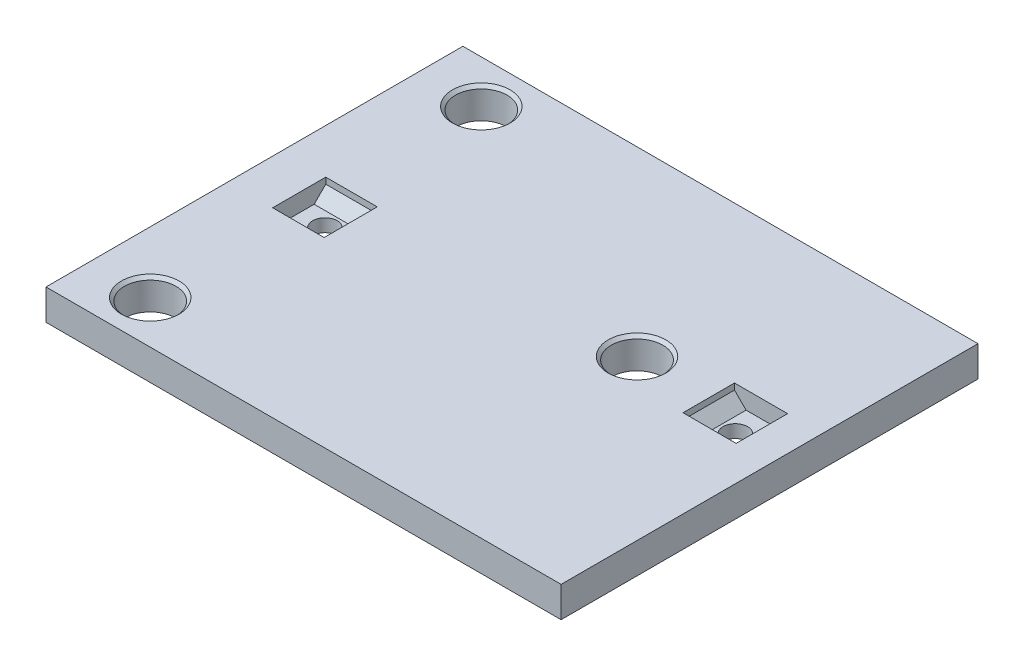
ISO-10303-21;
HEADER;
FILE_DESCRIPTION(('STEP AP214'),'2;1');
FILE_NAME('part.step','',(''),(''),'','','');
FILE_SCHEMA(('AUTOMOTIVE_DESIGN { 1 0 10303 214 1 1 1 1 }'));
ENDSEC;
DATA;
#1=APPLICATION_CONTEXT('core data for automotive mechanical design processes');
#2=APPLICATION_PROTOCOL_DEFINITION('international standard','automotive_design',2000,#1);
#3=PRODUCT_CONTEXT('',#1,'mechanical');
#4=PRODUCT('Part','Part','',(#3));
#5=PRODUCT_RELATED_PRODUCT_CATEGORY('part','',(#4));
#6=PRODUCT_DEFINITION_FORMATION('','',#4);
#7=PRODUCT_DEFINITION_CONTEXT('part definition',#1,'design');
#8=PRODUCT_DEFINITION('design','',#6,#7);
#9=PRODUCT_DEFINITION_SHAPE('','',#8);
#10=(LENGTH_UNIT() NAMED_UNIT(*) SI_UNIT(.MILLI.,.METRE.));
#11=(NAMED_UNIT(*) PLANE_ANGLE_UNIT() SI_UNIT($,.RADIAN.));
#12=(NAMED_UNIT(*) SI_UNIT($,.STERADIAN.) SOLID_ANGLE_UNIT());
#13=UNCERTAINTY_MEASURE_WITH_UNIT(LENGTH_MEASURE(1.E-05),#10,'distance_accuracy_value','');
#14=(GEOMETRIC_REPRESENTATION_CONTEXT(3) GLOBAL_UNCERTAINTY_ASSIGNED_CONTEXT((#13)) GLOBAL_UNIT_ASSIGNED_CONTEXT((#10,
#11,#12)) REPRESENTATION_CONTEXT('',''));
#15=CARTESIAN_POINT('',(0.,0.,0.));
#16=DIRECTION('',(0.,0.,1.));
#17=DIRECTION('',(1.,0.,0.));
#18=AXIS2_PLACEMENT_3D('',#15,#16,#17);
#19=CARTESIAN_POINT('',(94.0391837365436,6.35,-48.7466951694004));
#20=DIRECTION('',(0.,-1.,0.));
#21=DIRECTION('',(0.,0.,-1.));
#22=AXIS2_PLACEMENT_3D('',#19,#20,#21);
#23=CYLINDRICAL_SURFACE('',#22,2.54);
#24=CARTESIAN_POINT('',(94.0391837365436,0.,-48.7466951694004));
#25=DIRECTION('',(0.,1.,0.));
#26=DIRECTION('',(0.,0.,1.));
#27=AXIS2_PLACEMENT_3D('',#24,#25,#26);
#28=CIRCLE('',#27,2.54);
#29=CARTESIAN_POINT('',(94.0391837365436,0.,-46.2066951694004));
#30=VERTEX_POINT('',#29);
#31=EDGE_CURVE('E300',#30,#30,#28,.T.);
#32=ORIENTED_EDGE('',*,*,#31,.F.);
#33=EDGE_LOOP('',(#32));
#34=FACE_BOUND('',#33,.T.);
#35=CARTESIAN_POINT('',(94.0391837365436,2.68000000000001,-48.7466951694004));
#36=DIRECTION('',(0.,1.,0.));
#37=DIRECTION('',(-1.,0.,0.));
#38=AXIS2_PLACEMENT_3D('',#35,#36,#37);
#39=CIRCLE('',#38,2.54);
#40=CARTESIAN_POINT('',(91.4991837365436,2.68000000000001,-48.7466951694004));
#41=VERTEX_POINT('',#40);
#42=EDGE_CURVE('E169',#41,#41,#39,.T.);
#43=ORIENTED_EDGE('',*,*,#42,.T.);
#44=EDGE_LOOP('',(#43));
#45=FACE_BOUND('',#44,.T.);
#46=ADVANCED_FACE('F40',(#34,#45),#23,.F.);
#47=CARTESIAN_POINT('',(14.605,6.35,-43.18));
#48=DIRECTION('',(0.,-1.,0.));
#49=DIRECTION('',(0.,0.,-1.));
#50=AXIS2_PLACEMENT_3D('',#47,#48,#49);
#51=CYLINDRICAL_SURFACE('',#50,2.54);
#52=CARTESIAN_POINT('',(14.605,0.,-43.18));
#53=DIRECTION('',(0.,1.,0.));
#54=DIRECTION('',(0.,0.,1.));
#55=AXIS2_PLACEMENT_3D('',#52,#53,#54);
#56=CIRCLE('',#55,2.54);
#57=CARTESIAN_POINT('',(14.605,0.,-40.64));
#58=VERTEX_POINT('',#57);
#59=EDGE_CURVE('E296',#58,#58,#56,.T.);
#60=ORIENTED_EDGE('',*,*,#59,.F.);
#61=EDGE_LOOP('',(#60));
#62=FACE_BOUND('',#61,.T.);
#63=CARTESIAN_POINT('',(14.605,2.68000000000001,-43.18));
#64=DIRECTION('',(0.,1.,0.));
#65=DIRECTION('',(0.,0.,1.));
#66=AXIS2_PLACEMENT_3D('',#63,#64,#65);
#67=CIRCLE('',#66,2.54);
#68=CARTESIAN_POINT('',(14.605,2.68000000000001,-40.64));
#69=VERTEX_POINT('',#68);
#70=EDGE_CURVE('E295',#69,#69,#67,.T.);
#71=ORIENTED_EDGE('',*,*,#70,.T.);
#72=EDGE_LOOP('',(#71));
#73=FACE_BOUND('',#72,.T.);
#74=ADVANCED_FACE('F384',(#62,#73),#51,.F.);
#75=CARTESIAN_POINT('',(0.,6.35,0.));
#76=DIRECTION('',(0.,1.,0.));
#77=DIRECTION('',(0.,0.,1.));
#78=AXIS2_PLACEMENT_3D('',#75,#76,#77);
#79=PLANE('',#78);
#80=CARTESIAN_POINT('',(12.7,6.35,-8.89));
#81=DIRECTION('',(0.,1.,0.));
#82=DIRECTION('',(0.,0.,1.));
#83=AXIS2_PLACEMENT_3D('',#80,#81,#82);
#84=CIRCLE('',#83,5.96899999999999);
#85=CARTESIAN_POINT('',(12.7,6.35,-2.92100000000001));
#86=VERTEX_POINT('',#85);
#87=EDGE_CURVE('E360',#86,#86,#84,.F.);
#88=ORIENTED_EDGE('',*,*,#87,.T.);
#89=EDGE_LOOP('',(#88));
#90=FACE_BOUND('',#89,.T.);
#91=CARTESIAN_POINT('',(73.6809890273244,6.35,-48.7466951694004));
#92=DIRECTION('',(0.,1.,0.));
#93=DIRECTION('',(0.,0.,1.));
#94=AXIS2_PLACEMENT_3D('',#91,#92,#93);
#95=CIRCLE('',#94,5.96900000000004);
#96=CARTESIAN_POINT('',(73.6809890273244,6.35,-42.7776951694004));
#97=VERTEX_POINT('',#96);
#98=EDGE_CURVE('E356',#97,#97,#95,.F.);
#99=ORIENTED_EDGE('',*,*,#98,.T.);
#100=EDGE_LOOP('',(#99));
#101=FACE_BOUND('',#100,.T.);
#102=CARTESIAN_POINT('',(12.7,6.35,-77.47));
#103=DIRECTION('',(0.,1.,0.));
#104=DIRECTION('',(0.,0.,1.));
#105=AXIS2_PLACEMENT_3D('',#102,#103,#104);
#106=CIRCLE('',#105,5.969);
#107=CARTESIAN_POINT('',(12.7,6.35,-71.501));
#108=VERTEX_POINT('',#107);
#109=EDGE_CURVE('E346',#108,#108,#106,.F.);
#110=ORIENTED_EDGE('',*,*,#109,.T.);
#111=EDGE_LOOP('',(#110));
#112=FACE_BOUND('',#111,.T.);
#113=DIRECTION('',(-1.,0.,0.));
#114=VECTOR('',#113,1.);
#115=CARTESIAN_POINT('',(99.5391837365436,6.35,-43.4126951694004));
#116=LINE('',#115,#114);
#117=CARTESIAN_POINT('',(99.5391837365436,6.35,-43.4126951694004));
#118=VERTEX_POINT('',#117);
#119=CARTESIAN_POINT('',(88.5391837365436,6.35,-43.4126951694004));
#120=VERTEX_POINT('',#119);
#121=EDGE_CURVE('E214',#118,#120,#116,.T.);
#122=ORIENTED_EDGE('',*,*,#121,.T.);
#123=DIRECTION('',(0.,0.,-1.));
#124=VECTOR('',#123,1.);
#125=CARTESIAN_POINT('',(88.5391837365436,6.35,-43.4126951694004));
#126=LINE('',#125,#124);
#127=CARTESIAN_POINT('',(88.5391837365436,6.35,-54.0806951694004));
#128=VERTEX_POINT('',#127);
#129=EDGE_CURVE('E224',#120,#128,#126,.T.);
#130=ORIENTED_EDGE('',*,*,#129,.T.);
#131=DIRECTION('',(-1.,0.,0.));
#132=VECTOR('',#131,1.);
#133=CARTESIAN_POINT('',(99.5391837365436,6.35,-54.0806951694004));
#134=LINE('',#133,#132);
#135=CARTESIAN_POINT('',(99.5391837365436,6.35,-54.0806951694004));
#136=VERTEX_POINT('',#135);
#137=EDGE_CURVE('E198',#136,#128,#134,.T.);
#138=ORIENTED_EDGE('',*,*,#137,.F.);
#139=DIRECTION('',(0.,0.,-1.));
#140=VECTOR('',#139,1.);
#141=CARTESIAN_POINT('',(99.5391837365436,6.35,-43.4126951694004));
#142=LINE('',#141,#140);
#143=EDGE_CURVE('E228',#118,#136,#142,.T.);
#144=ORIENTED_EDGE('',*,*,#143,.F.);
#145=EDGE_LOOP('',(#122,#130,#138,#144));
#146=FACE_BOUND('',#145,.T.);
#147=DIRECTION('',(0.,0.,-1.));
#148=VECTOR('',#147,1.);
#149=CARTESIAN_POINT('',(9.271,6.35,-37.68));
#150=LINE('',#149,#148);
#151=CARTESIAN_POINT('',(9.271,6.35,-37.68));
#152=VERTEX_POINT('',#151);
#153=CARTESIAN_POINT('',(9.271,6.35,-48.68));
#154=VERTEX_POINT('',#153);
#155=EDGE_CURVE('E269',#152,#154,#150,.T.);
#156=ORIENTED_EDGE('',*,*,#155,.T.);
#157=DIRECTION('',(1.,0.,0.));
#158=VECTOR('',#157,1.);
#159=CARTESIAN_POINT('',(9.271,6.35,-48.68));
#160=LINE('',#159,#158);
#161=CARTESIAN_POINT('',(19.939,6.35,-48.68));
#162=VERTEX_POINT('',#161);
#163=EDGE_CURVE('E279',#154,#162,#160,.T.);
#164=ORIENTED_EDGE('',*,*,#163,.T.);
#165=DIRECTION('',(0.,0.,-1.));
#166=VECTOR('',#165,1.);
#167=CARTESIAN_POINT('',(19.939,6.35,-37.68));
#168=LINE('',#167,#166);
#169=CARTESIAN_POINT('',(19.939,6.35,-37.68));
#170=VERTEX_POINT('',#169);
#171=EDGE_CURVE('E249',#170,#162,#168,.T.);
#172=ORIENTED_EDGE('',*,*,#171,.F.);
#173=DIRECTION('',(1.,0.,0.));
#174=VECTOR('',#173,1.);
#175=CARTESIAN_POINT('',(9.271,6.35,-37.68));
#176=LINE('',#175,#174);
#177=EDGE_CURVE('E283',#152,#170,#176,.T.);
#178=ORIENTED_EDGE('',*,*,#177,.F.);
#179=EDGE_LOOP('',(#156,#164,#172,#178));
#180=FACE_BOUND('',#179,.T.);
#181=DIRECTION('',(0.,0.,1.));
#182=VECTOR('',#181,1.);
#183=CARTESIAN_POINT('',(0.,6.35,-53.34));
#184=LINE('',#183,#182);
#185=CARTESIAN_POINT('',(0.,6.35,-86.36));
#186=VERTEX_POINT('',#185);
#187=CARTESIAN_POINT('',(0.,6.35,0.));
#188=VERTEX_POINT('',#187);
#189=EDGE_CURVE('E305',#186,#188,#184,.T.);
#190=ORIENTED_EDGE('',*,*,#189,.T.);
#191=DIRECTION('',(1.,0.,0.));
#192=VECTOR('',#191,1.);
#193=CARTESIAN_POINT('',(0.,6.35,0.));
#194=LINE('',#193,#192);
#195=CARTESIAN_POINT('',(106.700989027324,6.35,0.));
#196=VERTEX_POINT('',#195);
#197=EDGE_CURVE('E308',#188,#196,#194,.T.);
#198=ORIENTED_EDGE('',*,*,#197,.T.);
#199=DIRECTION('',(0.,0.,-1.));
#200=VECTOR('',#199,1.);
#201=CARTESIAN_POINT('',(106.700989027324,6.35,0.));
#202=LINE('',#201,#200);
#203=CARTESIAN_POINT('',(106.700989027324,6.35,-86.36));
#204=VERTEX_POINT('',#203);
#205=EDGE_CURVE('E312',#196,#204,#202,.T.);
#206=ORIENTED_EDGE('',*,*,#205,.T.);
#207=DIRECTION('',(-1.,0.,0.));
#208=VECTOR('',#207,1.);
#209=CARTESIAN_POINT('',(20.32,6.35,-86.36));
#210=LINE('',#209,#208);
#211=EDGE_CURVE('E315',#204,#186,#210,.T.);
#212=ORIENTED_EDGE('',*,*,#211,.T.);
#213=EDGE_LOOP('',(#190,#198,#206,#212));
#214=FACE_BOUND('',#213,.T.);
#215=ADVANCED_FACE('F380',(#90,#101,#112,#146,#180,#214),#79,.T.);
#216=CARTESIAN_POINT('',(0.,0.,0.));
#217=DIRECTION('',(0.,1.,0.));
#218=DIRECTION('',(0.,0.,1.));
#219=AXIS2_PLACEMENT_3D('',#216,#217,#218);
#220=PLANE('',#219);
#221=CARTESIAN_POINT('',(12.7,0.,-8.89));
#222=DIRECTION('',(0.,-1.,0.));
#223=DIRECTION('',(0.,0.,-1.));
#224=AXIS2_PLACEMENT_3D('',#221,#222,#223);
#225=CIRCLE('',#224,5.334);
#226=CARTESIAN_POINT('',(12.7,0.,-14.224));
#227=VERTEX_POINT('',#226);
#228=EDGE_CURVE('E184',#227,#227,#225,.T.);
#229=ORIENTED_EDGE('',*,*,#228,.F.);
#230=EDGE_LOOP('',(#229));
#231=FACE_BOUND('',#230,.T.);
#232=CARTESIAN_POINT('',(73.6809890273244,0.,-48.7466951694004));
#233=DIRECTION('',(0.,-1.,0.));
#234=DIRECTION('',(0.,0.,-1.));
#235=AXIS2_PLACEMENT_3D('',#232,#233,#234);
#236=CIRCLE('',#235,5.334);
#237=CARTESIAN_POINT('',(73.6809890273244,0.,-54.0806951694004));
#238=VERTEX_POINT('',#237);
#239=EDGE_CURVE('E188',#238,#238,#236,.T.);
#240=ORIENTED_EDGE('',*,*,#239,.F.);
#241=EDGE_LOOP('',(#240));
#242=FACE_BOUND('',#241,.T.);
#243=CARTESIAN_POINT('',(12.7,0.,-77.47));
#244=DIRECTION('',(0.,-1.,0.));
#245=DIRECTION('',(0.,0.,-1.));
#246=AXIS2_PLACEMENT_3D('',#243,#244,#245);
#247=CIRCLE('',#246,5.334);
#248=CARTESIAN_POINT('',(12.7,0.,-82.804));
#249=VERTEX_POINT('',#248);
#250=EDGE_CURVE('E191',#249,#249,#247,.T.);
#251=ORIENTED_EDGE('',*,*,#250,.F.);
#252=EDGE_LOOP('',(#251));
#253=FACE_BOUND('',#252,.T.);
#254=DIRECTION('',(1.,0.,0.));
#255=VECTOR('',#254,1.);
#256=CARTESIAN_POINT('',(22.86,0.,0.));
#257=LINE('',#256,#255);
#258=CARTESIAN_POINT('',(0.,0.,0.));
#259=VERTEX_POINT('',#258);
#260=CARTESIAN_POINT('',(106.700989027324,0.,0.));
#261=VERTEX_POINT('',#260);
#262=EDGE_CURVE('E304',#259,#261,#257,.T.);
#263=ORIENTED_EDGE('',*,*,#262,.F.);
#264=DIRECTION('',(0.,0.,1.));
#265=VECTOR('',#264,1.);
#266=CARTESIAN_POINT('',(0.,0.,-86.36));
#267=LINE('',#266,#265);
#268=CARTESIAN_POINT('',(0.,0.,-86.36));
#269=VERTEX_POINT('',#268);
#270=EDGE_CURVE('E309',#269,#259,#267,.T.);
#271=ORIENTED_EDGE('',*,*,#270,.F.);
#272=DIRECTION('',(-1.,0.,0.));
#273=VECTOR('',#272,1.);
#274=CARTESIAN_POINT('',(0.,0.,-86.36));
#275=LINE('',#274,#273);
#276=CARTESIAN_POINT('',(106.700989027324,0.,-86.36));
#277=VERTEX_POINT('',#276);
#278=EDGE_CURVE('E326',#277,#269,#275,.T.);
#279=ORIENTED_EDGE('',*,*,#278,.F.);
#280=DIRECTION('',(0.,0.,-1.));
#281=VECTOR('',#280,1.);
#282=CARTESIAN_POINT('',(106.700989027324,0.,-86.36));
#283=LINE('',#282,#281);
#284=EDGE_CURVE('E322',#261,#277,#283,.T.);
#285=ORIENTED_EDGE('',*,*,#284,.F.);
#286=EDGE_LOOP('',(#263,#271,#279,#285));
#287=FACE_BOUND('',#286,.T.);
#288=ORIENTED_EDGE('',*,*,#31,.T.);
#289=EDGE_LOOP('',(#288));
#290=FACE_BOUND('',#289,.T.);
#291=ORIENTED_EDGE('',*,*,#59,.T.);
#292=EDGE_LOOP('',(#291));
#293=FACE_BOUND('',#292,.T.);
#294=ADVANCED_FACE('F383',(#231,#242,#253,#287,#290,#293),#220,.F.);
#295=CARTESIAN_POINT('',(22.86,6.35,0.));
#296=DIRECTION('',(0.,0.,-1.));
#297=DIRECTION('',(-1.,0.,0.));
#298=AXIS2_PLACEMENT_3D('',#295,#296,#297);
#299=PLANE('',#298);
#300=ORIENTED_EDGE('',*,*,#262,.T.);
#301=DIRECTION('',(0.,-1.,0.));
#302=VECTOR('',#301,1.);
#303=CARTESIAN_POINT('',(106.700989027324,6.35,0.));
#304=LINE('',#303,#302);
#305=EDGE_CURVE('E338',#196,#261,#304,.T.);
#306=ORIENTED_EDGE('',*,*,#305,.F.);
#307=ORIENTED_EDGE('',*,*,#197,.F.);
#308=DIRECTION('',(0.,-1.,0.));
#309=VECTOR('',#308,1.);
#310=CARTESIAN_POINT('',(0.,6.35,0.));
#311=LINE('',#310,#309);
#312=EDGE_CURVE('E342',#188,#259,#311,.T.);
#313=ORIENTED_EDGE('',*,*,#312,.T.);
#314=EDGE_LOOP('',(#300,#306,#307,#313));
#315=FACE_BOUND('',#314,.T.);
#316=ADVANCED_FACE('F406',(#315),#299,.F.);
#317=CARTESIAN_POINT('',(106.700989027324,6.35,-86.36));
#318=DIRECTION('',(-1.,0.,0.));
#319=DIRECTION('',(0.,0.,1.));
#320=AXIS2_PLACEMENT_3D('',#317,#318,#319);
#321=PLANE('',#320);
#322=ORIENTED_EDGE('',*,*,#284,.T.);
#323=DIRECTION('',(0.,-1.,0.));
#324=VECTOR('',#323,1.);
#325=CARTESIAN_POINT('',(106.700989027324,6.35,-86.36));
#326=LINE('',#325,#324);
#327=EDGE_CURVE('E334',#204,#277,#326,.T.);
#328=ORIENTED_EDGE('',*,*,#327,.F.);
#329=ORIENTED_EDGE('',*,*,#205,.F.);
#330=ORIENTED_EDGE('',*,*,#305,.T.);
#331=EDGE_LOOP('',(#322,#328,#329,#330));
#332=FACE_BOUND('',#331,.T.);
#333=ADVANCED_FACE('F410',(#332),#321,.F.);
#334=CARTESIAN_POINT('',(0.,6.35,-86.36));
#335=DIRECTION('',(0.,0.,1.));
#336=DIRECTION('',(1.,0.,0.));
#337=AXIS2_PLACEMENT_3D('',#334,#335,#336);
#338=PLANE('',#337);
#339=ORIENTED_EDGE('',*,*,#278,.T.);
#340=DIRECTION('',(0.,-1.,0.));
#341=VECTOR('',#340,1.);
#342=CARTESIAN_POINT('',(0.,6.35,-86.36));
#343=LINE('',#342,#341);
#344=EDGE_CURVE('E318',#186,#269,#343,.T.);
#345=ORIENTED_EDGE('',*,*,#344,.F.);
#346=ORIENTED_EDGE('',*,*,#211,.F.);
#347=ORIENTED_EDGE('',*,*,#327,.T.);
#348=EDGE_LOOP('',(#339,#345,#346,#347));
#349=FACE_BOUND('',#348,.T.);
#350=ADVANCED_FACE('F412',(#349),#338,.F.);
#351=CARTESIAN_POINT('',(0.,6.35,-86.36));
#352=DIRECTION('',(1.,0.,0.));
#353=DIRECTION('',(0.,0.,-1.));
#354=AXIS2_PLACEMENT_3D('',#351,#352,#353);
#355=PLANE('',#354);
#356=ORIENTED_EDGE('',*,*,#270,.T.);
#357=ORIENTED_EDGE('',*,*,#312,.F.);
#358=ORIENTED_EDGE('',*,*,#189,.F.);
#359=ORIENTED_EDGE('',*,*,#344,.T.);
#360=EDGE_LOOP('',(#356,#357,#358,#359));
#361=FACE_BOUND('',#360,.T.);
#362=ADVANCED_FACE('F402',(#361),#355,.F.);
#363=CARTESIAN_POINT('',(9.271,5.08,-48.68));
#364=DIRECTION('',(0.,0.707106781186549,0.707106781186546));
#365=DIRECTION('',(0.,-0.707106781186546,0.707106781186549));
#366=AXIS2_PLACEMENT_3D('',#363,#364,#365);
#367=PLANE('',#366);
#368=DIRECTION('',(1.,0.,0.));
#369=VECTOR('',#368,1.);
#370=CARTESIAN_POINT('',(9.271,5.08,-48.68));
#371=LINE('',#370,#369);
#372=CARTESIAN_POINT('',(9.271,5.08,-48.68));
#373=VERTEX_POINT('',#372);
#374=CARTESIAN_POINT('',(19.939,5.08,-48.68));
#375=VERTEX_POINT('',#374);
#376=EDGE_CURVE('E276',#373,#375,#371,.T.);
#377=ORIENTED_EDGE('',*,*,#376,.F.);
#378=DIRECTION('',(0.,-0.707106781186546,0.707106781186549));
#379=VECTOR('',#378,1.);
#380=CARTESIAN_POINT('',(9.271,5.08,-48.68));
#381=LINE('',#380,#379);
#382=CARTESIAN_POINT('',(9.271,2.68000000000001,-46.28));
#383=VERTEX_POINT('',#382);
#384=EDGE_CURVE('E256',#373,#383,#381,.T.);
#385=ORIENTED_EDGE('',*,*,#384,.T.);
#386=DIRECTION('',(1.,0.,0.));
#387=VECTOR('',#386,1.);
#388=CARTESIAN_POINT('',(9.271,2.68000000000001,-46.28));
#389=LINE('',#388,#387);
#390=CARTESIAN_POINT('',(19.939,2.68000000000001,-46.28));
#391=VERTEX_POINT('',#390);
#392=EDGE_CURVE('E292',#383,#391,#389,.T.);
#393=ORIENTED_EDGE('',*,*,#392,.T.);
#394=DIRECTION('',(0.,-0.707106781186546,0.707106781186549));
#395=VECTOR('',#394,1.);
#396=CARTESIAN_POINT('',(19.939,5.08,-48.68));
#397=LINE('',#396,#395);
#398=EDGE_CURVE('E236',#375,#391,#397,.T.);
#399=ORIENTED_EDGE('',*,*,#398,.F.);
#400=EDGE_LOOP('',(#377,#385,#393,#399));
#401=FACE_BOUND('',#400,.T.);
#402=ADVANCED_FACE('F431',(#401),#367,.T.);
#403=CARTESIAN_POINT('',(9.271,2.68000000000001,-46.28));
#404=DIRECTION('',(0.,1.,0.));
#405=DIRECTION('',(0.,0.,1.));
#406=AXIS2_PLACEMENT_3D('',#403,#404,#405);
#407=PLANE('',#406);
#408=ORIENTED_EDGE('',*,*,#70,.F.);
#409=EDGE_LOOP('',(#408));
#410=FACE_BOUND('',#409,.T.);
#411=ORIENTED_EDGE('',*,*,#392,.F.);
#412=DIRECTION('',(0.,0.,1.));
#413=VECTOR('',#412,1.);
#414=CARTESIAN_POINT('',(9.271,2.68000000000001,-46.28));
#415=LINE('',#414,#413);
#416=CARTESIAN_POINT('',(9.271,2.68000000000001,-40.08));
#417=VERTEX_POINT('',#416);
#418=EDGE_CURVE('E260',#383,#417,#415,.T.);
#419=ORIENTED_EDGE('',*,*,#418,.T.);
#420=DIRECTION('',(1.,0.,0.));
#421=VECTOR('',#420,1.);
#422=CARTESIAN_POINT('',(9.271,2.68000000000001,-40.08));
#423=LINE('',#422,#421);
#424=CARTESIAN_POINT('',(19.939,2.68000000000001,-40.08));
#425=VERTEX_POINT('',#424);
#426=EDGE_CURVE('E289',#417,#425,#423,.T.);
#427=ORIENTED_EDGE('',*,*,#426,.T.);
#428=DIRECTION('',(0.,0.,1.));
#429=VECTOR('',#428,1.);
#430=CARTESIAN_POINT('',(19.939,2.68000000000001,-46.28));
#431=LINE('',#430,#429);
#432=EDGE_CURVE('E240',#391,#425,#431,.T.);
#433=ORIENTED_EDGE('',*,*,#432,.F.);
#434=EDGE_LOOP('',(#411,#419,#427,#433));
#435=FACE_BOUND('',#434,.T.);
#436=ADVANCED_FACE('F427',(#410,#435),#407,.T.);
#437=CARTESIAN_POINT('',(9.271,2.68000000000001,-40.08));
#438=DIRECTION('',(0.,0.707106781186549,-0.707106781186546));
#439=DIRECTION('',(0.,0.707106781186546,0.707106781186549));
#440=AXIS2_PLACEMENT_3D('',#437,#438,#439);
#441=PLANE('',#440);
#442=ORIENTED_EDGE('',*,*,#426,.F.);
#443=DIRECTION('',(0.,0.707106781186546,0.707106781186549));
#444=VECTOR('',#443,1.);
#445=CARTESIAN_POINT('',(9.271,2.68000000000001,-40.08));
#446=LINE('',#445,#444);
#447=CARTESIAN_POINT('',(9.271,5.08,-37.68));
#448=VERTEX_POINT('',#447);
#449=EDGE_CURVE('E263',#417,#448,#446,.T.);
#450=ORIENTED_EDGE('',*,*,#449,.T.);
#451=DIRECTION('',(1.,0.,0.));
#452=VECTOR('',#451,1.);
#453=CARTESIAN_POINT('',(9.271,5.08,-37.68));
#454=LINE('',#453,#452);
#455=CARTESIAN_POINT('',(19.939,5.08,-37.68));
#456=VERTEX_POINT('',#455);
#457=EDGE_CURVE('E286',#448,#456,#454,.T.);
#458=ORIENTED_EDGE('',*,*,#457,.T.);
#459=DIRECTION('',(0.,0.707106781186546,0.707106781186549));
#460=VECTOR('',#459,1.);
#461=CARTESIAN_POINT('',(19.939,2.68000000000001,-40.08));
#462=LINE('',#461,#460);
#463=EDGE_CURVE('E244',#425,#456,#462,.T.);
#464=ORIENTED_EDGE('',*,*,#463,.F.);
#465=EDGE_LOOP('',(#442,#450,#458,#464));
#466=FACE_BOUND('',#465,.T.);
#467=ADVANCED_FACE('F430',(#466),#441,.T.);
#468=CARTESIAN_POINT('',(9.271,5.08,-37.68));
#469=DIRECTION('',(0.,0.,-1.));
#470=DIRECTION('',(-1.,0.,0.));
#471=AXIS2_PLACEMENT_3D('',#468,#469,#470);
#472=PLANE('',#471);
#473=ORIENTED_EDGE('',*,*,#457,.F.);
#474=DIRECTION('',(0.,1.,0.));
#475=VECTOR('',#474,1.);
#476=CARTESIAN_POINT('',(9.271,5.08,-37.68));
#477=LINE('',#476,#475);
#478=EDGE_CURVE('E266',#448,#152,#477,.T.);
#479=ORIENTED_EDGE('',*,*,#478,.T.);
#480=ORIENTED_EDGE('',*,*,#177,.T.);
#481=DIRECTION('',(0.,1.,0.));
#482=VECTOR('',#481,1.);
#483=CARTESIAN_POINT('',(19.939,5.08,-37.68));
#484=LINE('',#483,#482);
#485=EDGE_CURVE('E65',#456,#170,#484,.T.);
#486=ORIENTED_EDGE('',*,*,#485,.F.);
#487=EDGE_LOOP('',(#473,#479,#480,#486));
#488=FACE_BOUND('',#487,.T.);
#489=ADVANCED_FACE('F449',(#488),#472,.T.);
#490=CARTESIAN_POINT('',(9.271,6.35,-48.68));
#491=DIRECTION('',(0.,0.,1.));
#492=DIRECTION('',(1.,0.,0.));
#493=AXIS2_PLACEMENT_3D('',#490,#491,#492);
#494=PLANE('',#493);
#495=ORIENTED_EDGE('',*,*,#163,.F.);
#496=DIRECTION('',(0.,-1.,0.));
#497=VECTOR('',#496,1.);
#498=CARTESIAN_POINT('',(9.271,6.35,-48.68));
#499=LINE('',#498,#497);
#500=EDGE_CURVE('E273',#154,#373,#499,.T.);
#501=ORIENTED_EDGE('',*,*,#500,.T.);
#502=ORIENTED_EDGE('',*,*,#376,.T.);
#503=DIRECTION('',(0.,-1.,0.));
#504=VECTOR('',#503,1.);
#505=CARTESIAN_POINT('',(19.939,6.35,-48.68));
#506=LINE('',#505,#504);
#507=EDGE_CURVE('E252',#162,#375,#506,.T.);
#508=ORIENTED_EDGE('',*,*,#507,.F.);
#509=EDGE_LOOP('',(#495,#501,#502,#508));
#510=FACE_BOUND('',#509,.T.);
#511=ADVANCED_FACE('F454',(#510),#494,.T.);
#512=CARTESIAN_POINT('',(9.271,0.,0.));
#513=DIRECTION('',(-1.,0.,0.));
#514=DIRECTION('',(0.,0.,1.));
#515=AXIS2_PLACEMENT_3D('',#512,#513,#514);
#516=PLANE('',#515);
#517=ORIENTED_EDGE('',*,*,#384,.F.);
#518=ORIENTED_EDGE('',*,*,#500,.F.);
#519=ORIENTED_EDGE('',*,*,#155,.F.);
#520=ORIENTED_EDGE('',*,*,#478,.F.);
#521=ORIENTED_EDGE('',*,*,#449,.F.);
#522=ORIENTED_EDGE('',*,*,#418,.F.);
#523=EDGE_LOOP('',(#517,#518,#519,#520,#521,#522));
#524=FACE_BOUND('',#523,.T.);
#525=ADVANCED_FACE('F442',(#524),#516,.F.);
#526=CARTESIAN_POINT('',(19.939,0.,0.));
#527=DIRECTION('',(-1.,0.,0.));
#528=DIRECTION('',(0.,0.,1.));
#529=AXIS2_PLACEMENT_3D('',#526,#527,#528);
#530=PLANE('',#529);
#531=ORIENTED_EDGE('',*,*,#398,.T.);
#532=ORIENTED_EDGE('',*,*,#432,.T.);
#533=ORIENTED_EDGE('',*,*,#463,.T.);
#534=ORIENTED_EDGE('',*,*,#485,.T.);
#535=ORIENTED_EDGE('',*,*,#171,.T.);
#536=ORIENTED_EDGE('',*,*,#507,.T.);
#537=EDGE_LOOP('',(#531,#532,#533,#534,#535,#536));
#538=FACE_BOUND('',#537,.T.);
#539=ADVANCED_FACE('F451',(#538),#530,.T.);
#540=CARTESIAN_POINT('',(88.5391837365436,5.08,-43.4126951694004));
#541=DIRECTION('',(0.707106781186546,0.707106781186549,0.));
#542=DIRECTION('',(-0.707106781186549,0.707106781186546,0.));
#543=AXIS2_PLACEMENT_3D('',#540,#541,#542);
#544=PLANE('',#543);
#545=DIRECTION('',(0.,0.,-1.));
#546=VECTOR('',#545,1.);
#547=CARTESIAN_POINT('',(88.5391837365436,5.08,-43.4126951694004));
#548=LINE('',#547,#546);
#549=CARTESIAN_POINT('',(88.5391837365436,5.08,-43.4126951694004));
#550=VERTEX_POINT('',#549);
#551=CARTESIAN_POINT('',(88.5391837365436,5.08,-54.0806951694004));
#552=VERTEX_POINT('',#551);
#553=EDGE_CURVE('E221',#550,#552,#548,.T.);
#554=ORIENTED_EDGE('',*,*,#553,.F.);
#555=DIRECTION('',(0.707106781186549,-0.707106781186546,0.));
#556=VECTOR('',#555,1.);
#557=CARTESIAN_POINT('',(88.5391837365436,5.08,-43.4126951694004));
#558=LINE('',#557,#556);
#559=CARTESIAN_POINT('',(90.9391837365436,2.68000000000001,-43.4126951694004));
#560=VERTEX_POINT('',#559);
#561=EDGE_CURVE('E166',#550,#560,#558,.T.);
#562=ORIENTED_EDGE('',*,*,#561,.T.);
#563=DIRECTION('',(0.,0.,-1.));
#564=VECTOR('',#563,1.);
#565=CARTESIAN_POINT('',(90.9391837365436,2.68000000000001,-43.4126951694004));
#566=LINE('',#565,#564);
#567=CARTESIAN_POINT('',(90.9391837365436,2.68000000000001,-54.0806951694004));
#568=VERTEX_POINT('',#567);
#569=EDGE_CURVE('E158',#560,#568,#566,.T.);
#570=ORIENTED_EDGE('',*,*,#569,.T.);
#571=DIRECTION('',(0.707106781186549,-0.707106781186546,0.));
#572=VECTOR('',#571,1.);
#573=CARTESIAN_POINT('',(88.5391837365436,5.08,-54.0806951694004));
#574=LINE('',#573,#572);
#575=EDGE_CURVE('E163',#552,#568,#574,.T.);
#576=ORIENTED_EDGE('',*,*,#575,.F.);
#577=EDGE_LOOP('',(#554,#562,#570,#576));
#578=FACE_BOUND('',#577,.T.);
#579=ADVANCED_FACE('F161',(#578),#544,.T.);
#580=CARTESIAN_POINT('',(90.9391837365436,2.68000000000001,-43.4126951694004));
#581=DIRECTION('',(0.,1.,0.));
#582=DIRECTION('',(-1.,0.,0.));
#583=AXIS2_PLACEMENT_3D('',#580,#581,#582);
#584=PLANE('',#583);
#585=ORIENTED_EDGE('',*,*,#42,.F.);
#586=EDGE_LOOP('',(#585));
#587=FACE_BOUND('',#586,.T.);
#588=ORIENTED_EDGE('',*,*,#569,.F.);
#589=DIRECTION('',(1.,0.,0.));
#590=VECTOR('',#589,1.);
#591=CARTESIAN_POINT('',(90.9391837365436,2.68000000000001,-43.4126951694004));
#592=LINE('',#591,#590);
#593=CARTESIAN_POINT('',(97.1391837365436,2.68000000000001,-43.4126951694004));
#594=VERTEX_POINT('',#593);
#595=EDGE_CURVE('E205',#560,#594,#592,.T.);
#596=ORIENTED_EDGE('',*,*,#595,.T.);
#597=DIRECTION('',(0.,0.,-1.));
#598=VECTOR('',#597,1.);
#599=CARTESIAN_POINT('',(97.1391837365436,2.68000000000001,-43.4126951694004));
#600=LINE('',#599,#598);
#601=CARTESIAN_POINT('',(97.1391837365436,2.68000000000001,-54.0806951694004));
#602=VERTEX_POINT('',#601);
#603=EDGE_CURVE('E170',#594,#602,#600,.T.);
#604=ORIENTED_EDGE('',*,*,#603,.T.);
#605=DIRECTION('',(1.,0.,0.));
#606=VECTOR('',#605,1.);
#607=CARTESIAN_POINT('',(90.9391837365436,2.68000000000001,-54.0806951694004));
#608=LINE('',#607,#606);
#609=EDGE_CURVE('E173',#568,#602,#608,.T.);
#610=ORIENTED_EDGE('',*,*,#609,.F.);
#611=EDGE_LOOP('',(#588,#596,#604,#610));
#612=FACE_BOUND('',#611,.T.);
#613=ADVANCED_FACE('F174',(#587,#612),#584,.T.);
#614=CARTESIAN_POINT('',(97.1391837365436,2.68000000000001,-43.4126951694004));
#615=DIRECTION('',(-0.707106781186546,0.707106781186549,0.));
#616=DIRECTION('',(-0.707106781186549,-0.707106781186546,0.));
#617=AXIS2_PLACEMENT_3D('',#614,#615,#616);
#618=PLANE('',#617);
#619=ORIENTED_EDGE('',*,*,#603,.F.);
#620=DIRECTION('',(0.707106781186549,0.707106781186546,0.));
#621=VECTOR('',#620,1.);
#622=CARTESIAN_POINT('',(97.1391837365436,2.68000000000001,-43.4126951694004));
#623=LINE('',#622,#621);
#624=CARTESIAN_POINT('',(99.5391837365436,5.08,-43.4126951694004));
#625=VERTEX_POINT('',#624);
#626=EDGE_CURVE('E208',#594,#625,#623,.T.);
#627=ORIENTED_EDGE('',*,*,#626,.T.);
#628=DIRECTION('',(0.,0.,-1.));
#629=VECTOR('',#628,1.);
#630=CARTESIAN_POINT('',(99.5391837365436,5.08,-43.4126951694004));
#631=LINE('',#630,#629);
#632=CARTESIAN_POINT('',(99.5391837365436,5.08,-54.0806951694004));
#633=VERTEX_POINT('',#632);
#634=EDGE_CURVE('E231',#625,#633,#631,.T.);
#635=ORIENTED_EDGE('',*,*,#634,.T.);
#636=DIRECTION('',(0.707106781186549,0.707106781186546,0.));
#637=VECTOR('',#636,1.);
#638=CARTESIAN_POINT('',(97.1391837365436,2.68000000000001,-54.0806951694004));
#639=LINE('',#638,#637);
#640=EDGE_CURVE('E178',#602,#633,#639,.T.);
#641=ORIENTED_EDGE('',*,*,#640,.F.);
#642=EDGE_LOOP('',(#619,#627,#635,#641));
#643=FACE_BOUND('',#642,.T.);
#644=ADVANCED_FACE('F532',(#643),#618,.T.);
#645=CARTESIAN_POINT('',(99.5391837365436,5.08,-43.4126951694004));
#646=DIRECTION('',(-1.,0.,0.));
#647=DIRECTION('',(0.,0.,1.));
#648=AXIS2_PLACEMENT_3D('',#645,#646,#647);
#649=PLANE('',#648);
#650=ORIENTED_EDGE('',*,*,#634,.F.);
#651=DIRECTION('',(0.,1.,0.));
#652=VECTOR('',#651,1.);
#653=CARTESIAN_POINT('',(99.5391837365436,5.08,-43.4126951694004));
#654=LINE('',#653,#652);
#655=EDGE_CURVE('E211',#625,#118,#654,.T.);
#656=ORIENTED_EDGE('',*,*,#655,.T.);
#657=ORIENTED_EDGE('',*,*,#143,.T.);
#658=DIRECTION('',(0.,1.,0.));
#659=VECTOR('',#658,1.);
#660=CARTESIAN_POINT('',(99.5391837365436,5.08,-54.0806951694004));
#661=LINE('',#660,#659);
#662=EDGE_CURVE('E57',#633,#136,#661,.T.);
#663=ORIENTED_EDGE('',*,*,#662,.F.);
#664=EDGE_LOOP('',(#650,#656,#657,#663));
#665=FACE_BOUND('',#664,.T.);
#666=ADVANCED_FACE('F528',(#665),#649,.T.);
#667=CARTESIAN_POINT('',(88.5391837365436,6.35,-43.4126951694004));
#668=DIRECTION('',(1.,0.,0.));
#669=DIRECTION('',(0.,0.,-1.));
#670=AXIS2_PLACEMENT_3D('',#667,#668,#669);
#671=PLANE('',#670);
#672=ORIENTED_EDGE('',*,*,#129,.F.);
#673=DIRECTION('',(0.,-1.,0.));
#674=VECTOR('',#673,1.);
#675=CARTESIAN_POINT('',(88.5391837365436,6.35,-43.4126951694004));
#676=LINE('',#675,#674);
#677=EDGE_CURVE('E218',#120,#550,#676,.T.);
#678=ORIENTED_EDGE('',*,*,#677,.T.);
#679=ORIENTED_EDGE('',*,*,#553,.T.);
#680=DIRECTION('',(0.,-1.,0.));
#681=VECTOR('',#680,1.);
#682=CARTESIAN_POINT('',(88.5391837365436,6.35,-54.0806951694004));
#683=LINE('',#682,#681);
#684=EDGE_CURVE('E182',#128,#552,#683,.T.);
#685=ORIENTED_EDGE('',*,*,#684,.F.);
#686=EDGE_LOOP('',(#672,#678,#679,#685));
#687=FACE_BOUND('',#686,.T.);
#688=ADVANCED_FACE('F524',(#687),#671,.T.);
#689=CARTESIAN_POINT('',(0.,0.,-43.4126951694004));
#690=DIRECTION('',(0.,0.,1.));
#691=DIRECTION('',(1.,0.,0.));
#692=AXIS2_PLACEMENT_3D('',#689,#690,#691);
#693=PLANE('',#692);
#694=ORIENTED_EDGE('',*,*,#561,.F.);
#695=ORIENTED_EDGE('',*,*,#677,.F.);
#696=ORIENTED_EDGE('',*,*,#121,.F.);
#697=ORIENTED_EDGE('',*,*,#655,.F.);
#698=ORIENTED_EDGE('',*,*,#626,.F.);
#699=ORIENTED_EDGE('',*,*,#595,.F.);
#700=EDGE_LOOP('',(#694,#695,#696,#697,#698,#699));
#701=FACE_BOUND('',#700,.T.);
#702=ADVANCED_FACE('F521',(#701),#693,.F.);
#703=CARTESIAN_POINT('',(0.,0.,-54.0806951694004));
#704=DIRECTION('',(0.,0.,1.));
#705=DIRECTION('',(1.,0.,0.));
#706=AXIS2_PLACEMENT_3D('',#703,#704,#705);
#707=PLANE('',#706);
#708=ORIENTED_EDGE('',*,*,#575,.T.);
#709=ORIENTED_EDGE('',*,*,#609,.T.);
#710=ORIENTED_EDGE('',*,*,#640,.T.);
#711=ORIENTED_EDGE('',*,*,#662,.T.);
#712=ORIENTED_EDGE('',*,*,#137,.T.);
#713=ORIENTED_EDGE('',*,*,#684,.T.);
#714=EDGE_LOOP('',(#708,#709,#710,#711,#712,#713));
#715=FACE_BOUND('',#714,.T.);
#716=ADVANCED_FACE('F180',(#715),#707,.T.);
#717=CARTESIAN_POINT('',(12.7,6.35,-77.47));
#718=DIRECTION('',(0.,-1.,0.));
#719=DIRECTION('',(0.,0.,-1.));
#720=AXIS2_PLACEMENT_3D('',#717,#718,#719);
#721=CYLINDRICAL_SURFACE('',#720,5.334);
#722=CARTESIAN_POINT('',(12.7,5.71500000000001,-77.47));
#723=DIRECTION('',(0.,1.,0.));
#724=DIRECTION('',(0.,0.,1.));
#725=AXIS2_PLACEMENT_3D('',#722,#723,#724);
#726=CIRCLE('',#725,5.334);
#727=CARTESIAN_POINT('',(12.7,5.71500000000001,-72.136));
#728=VERTEX_POINT('',#727);
#729=EDGE_CURVE('E11',#728,#728,#726,.T.);
#730=ORIENTED_EDGE('',*,*,#729,.T.);
#731=EDGE_LOOP('',(#730));
#732=FACE_BOUND('',#731,.T.);
#733=ORIENTED_EDGE('',*,*,#250,.T.);
#734=EDGE_LOOP('',(#733));
#735=FACE_BOUND('',#734,.T.);
#736=ADVANCED_FACE('F511',(#732,#735),#721,.F.);
#737=CARTESIAN_POINT('',(73.6809890273244,6.35,-48.7466951694004));
#738=DIRECTION('',(0.,-1.,0.));
#739=DIRECTION('',(0.,0.,-1.));
#740=AXIS2_PLACEMENT_3D('',#737,#738,#739);
#741=CYLINDRICAL_SURFACE('',#740,5.334);
#742=CARTESIAN_POINT('',(73.6809890273244,5.71499999999997,-48.7466951694004));
#743=DIRECTION('',(0.,1.,0.));
#744=DIRECTION('',(0.,0.,1.));
#745=AXIS2_PLACEMENT_3D('',#742,#743,#744);
#746=CIRCLE('',#745,5.334);
#747=CARTESIAN_POINT('',(73.6809890273244,5.71499999999997,-43.4126951694004));
#748=VERTEX_POINT('',#747);
#749=EDGE_CURVE('E50',#748,#748,#746,.T.);
#750=ORIENTED_EDGE('',*,*,#749,.T.);
#751=EDGE_LOOP('',(#750));
#752=FACE_BOUND('',#751,.T.);
#753=ORIENTED_EDGE('',*,*,#239,.T.);
#754=EDGE_LOOP('',(#753));
#755=FACE_BOUND('',#754,.T.);
#756=ADVANCED_FACE('F371',(#752,#755),#741,.F.);
#757=CARTESIAN_POINT('',(12.7,6.35,-8.89));
#758=DIRECTION('',(0.,-1.,0.));
#759=DIRECTION('',(0.,0.,-1.));
#760=AXIS2_PLACEMENT_3D('',#757,#758,#759);
#761=CYLINDRICAL_SURFACE('',#760,5.334);
#762=CARTESIAN_POINT('',(12.7,5.715,-8.89));
#763=DIRECTION('',(0.,1.,0.));
#764=DIRECTION('',(0.,0.,1.));
#765=AXIS2_PLACEMENT_3D('',#762,#763,#764);
#766=CIRCLE('',#765,5.334);
#767=CARTESIAN_POINT('',(12.7,5.715,-3.556));
#768=VERTEX_POINT('',#767);
#769=EDGE_CURVE('E364',#768,#768,#766,.T.);
#770=ORIENTED_EDGE('',*,*,#769,.T.);
#771=EDGE_LOOP('',(#770));
#772=FACE_BOUND('',#771,.T.);
#773=ORIENTED_EDGE('',*,*,#228,.T.);
#774=EDGE_LOOP('',(#773));
#775=FACE_BOUND('',#774,.T.);
#776=ADVANCED_FACE('F484',(#772,#775),#761,.F.);
#777=CARTESIAN_POINT('',(12.7,6.35,-8.89));
#778=DIRECTION('',(0.,1.,0.));
#779=DIRECTION('',(0.,0.,1.));
#780=AXIS2_PLACEMENT_3D('',#777,#778,#779);
#781=CONICAL_SURFACE('',#780,5.96899999999999,0.785398163397441);
#782=ORIENTED_EDGE('',*,*,#769,.F.);
#783=EDGE_LOOP('',(#782));
#784=FACE_BOUND('',#783,.T.);
#785=ORIENTED_EDGE('',*,*,#87,.F.);
#786=EDGE_LOOP('',(#785));
#787=FACE_BOUND('',#786,.T.);
#788=ADVANCED_FACE('F377',(#784,#787),#781,.F.);
#789=CARTESIAN_POINT('',(73.6809890273244,6.35,-48.7466951694004));
#790=DIRECTION('',(0.,1.,0.));
#791=DIRECTION('',(0.,0.,1.));
#792=AXIS2_PLACEMENT_3D('',#789,#790,#791);
#793=CONICAL_SURFACE('',#792,5.96900000000004,0.785398163397456);
#794=ORIENTED_EDGE('',*,*,#749,.F.);
#795=EDGE_LOOP('',(#794));
#796=FACE_BOUND('',#795,.T.);
#797=ORIENTED_EDGE('',*,*,#98,.F.);
#798=EDGE_LOOP('',(#797));
#799=FACE_BOUND('',#798,.T.);
#800=ADVANCED_FACE('F374',(#796,#799),#793,.F.);
#801=CARTESIAN_POINT('',(12.7,6.35,-77.47));
#802=DIRECTION('',(0.,1.,0.));
#803=DIRECTION('',(0.,0.,1.));
#804=AXIS2_PLACEMENT_3D('',#801,#802,#803);
#805=CONICAL_SURFACE('',#804,5.969,0.785398163397456);
#806=ORIENTED_EDGE('',*,*,#729,.F.);
#807=EDGE_LOOP('',(#806));
#808=FACE_BOUND('',#807,.T.);
#809=ORIENTED_EDGE('',*,*,#109,.F.);
#810=EDGE_LOOP('',(#809));
#811=FACE_BOUND('',#810,.T.);
#812=ADVANCED_FACE('F43',(#808,#811),#805,.F.);
#813=CLOSED_SHELL('',(#46,#74,#215,#294,#316,#333,#350,#362,#402,#436,#467,#489,#511,#525,#539,
#579,#613,#644,#666,#688,#702,#716,#736,#756,#776,#788,#800,#812));
#814=MANIFOLD_SOLID_BREP('B2',#813);
#815=ADVANCED_BREP_SHAPE_REPRESENTATION('',(#18,#814),#14);
#816=SHAPE_DEFINITION_REPRESENTATION(#9,#815);
ENDSEC;
END-ISO-10303-21;
